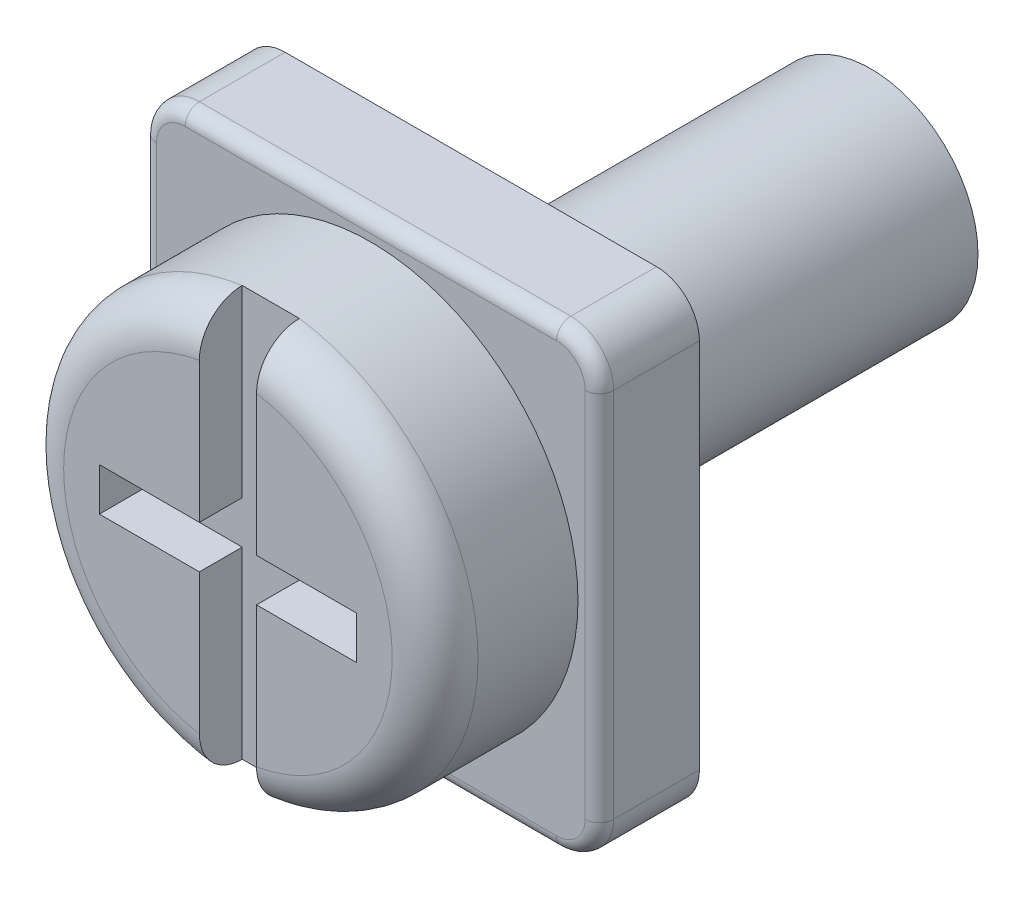
ISO-10303-21;
HEADER;
FILE_DESCRIPTION(('STEP AP214'),'2;1');
FILE_NAME('part.step','',(''),(''),'','','');
FILE_SCHEMA(('AUTOMOTIVE_DESIGN { 1 0 10303 214 1 1 1 1 }'));
ENDSEC;
DATA;
#1=APPLICATION_CONTEXT('core data for automotive mechanical design processes');
#2=APPLICATION_PROTOCOL_DEFINITION('international standard','automotive_design',2000,#1);
#3=PRODUCT_CONTEXT('',#1,'mechanical');
#4=PRODUCT('Part','Part','',(#3));
#5=PRODUCT_RELATED_PRODUCT_CATEGORY('part','',(#4));
#6=PRODUCT_DEFINITION_FORMATION('','',#4);
#7=PRODUCT_DEFINITION_CONTEXT('part definition',#1,'design');
#8=PRODUCT_DEFINITION('design','',#6,#7);
#9=PRODUCT_DEFINITION_SHAPE('','',#8);
#10=(LENGTH_UNIT() NAMED_UNIT(*) SI_UNIT(.MILLI.,.METRE.));
#11=(NAMED_UNIT(*) PLANE_ANGLE_UNIT() SI_UNIT($,.RADIAN.));
#12=(NAMED_UNIT(*) SI_UNIT($,.STERADIAN.) SOLID_ANGLE_UNIT());
#13=UNCERTAINTY_MEASURE_WITH_UNIT(LENGTH_MEASURE(1.E-05),#10,'distance_accuracy_value','');
#14=(GEOMETRIC_REPRESENTATION_CONTEXT(3) GLOBAL_UNCERTAINTY_ASSIGNED_CONTEXT((#13)) GLOBAL_UNIT_ASSIGNED_CONTEXT((#10,
#11,#12)) REPRESENTATION_CONTEXT('',''));
#15=CARTESIAN_POINT('',(0.,0.,0.));
#16=DIRECTION('',(0.,0.,1.));
#17=DIRECTION('',(1.,0.,0.));
#18=AXIS2_PLACEMENT_3D('',#15,#16,#17);
#19=CARTESIAN_POINT('',(0.,0.,2.));
#20=DIRECTION('',(0.,0.,1.));
#21=DIRECTION('',(1.,0.,0.));
#22=AXIS2_PLACEMENT_3D('',#19,#20,#21);
#23=PLANE('',#22);
#24=DIRECTION('',(0.,-1.,0.));
#25=VECTOR('',#24,1.);
#26=CARTESIAN_POINT('',(-0.4,2.87228132326901,2.));
#27=LINE('',#26,#25);
#28=CARTESIAN_POINT('',(-0.4,2.26495033058122,2.));
#29=VERTEX_POINT('',#28);
#30=CARTESIAN_POINT('',(-0.4,0.3,2.));
#31=VERTEX_POINT('',#30);
#32=EDGE_CURVE('E337',#29,#31,#27,.T.);
#33=ORIENTED_EDGE('',*,*,#32,.F.);
#34=CARTESIAN_POINT('',(0.,0.,2.));
#35=DIRECTION('',(0.,0.,1.));
#36=DIRECTION('',(1.,0.,0.));
#37=AXIS2_PLACEMENT_3D('',#34,#35,#36);
#38=CIRCLE('',#37,2.3);
#39=CARTESIAN_POINT('',(-0.4,-2.26495033058123,2.));
#40=VERTEX_POINT('',#39);
#41=EDGE_CURVE('E206',#29,#40,#38,.T.);
#42=ORIENTED_EDGE('',*,*,#41,.T.);
#43=DIRECTION('',(0.,-1.,0.));
#44=VECTOR('',#43,1.);
#45=CARTESIAN_POINT('',(-0.4,-0.299999999999999,2.));
#46=LINE('',#45,#44);
#47=CARTESIAN_POINT('',(-0.4,-0.299999999999999,2.));
#48=VERTEX_POINT('',#47);
#49=EDGE_CURVE('E200',#48,#40,#46,.T.);
#50=ORIENTED_EDGE('',*,*,#49,.F.);
#51=DIRECTION('',(1.,0.,0.));
#52=VECTOR('',#51,1.);
#53=CARTESIAN_POINT('',(-1.8,-0.3,2.));
#54=LINE('',#53,#52);
#55=CARTESIAN_POINT('',(-1.8,-0.3,2.));
#56=VERTEX_POINT('',#55);
#57=EDGE_CURVE('E368',#56,#48,#54,.T.);
#58=ORIENTED_EDGE('',*,*,#57,.F.);
#59=DIRECTION('',(0.,-1.,0.));
#60=VECTOR('',#59,1.);
#61=CARTESIAN_POINT('',(-1.8,0.3,2.));
#62=LINE('',#61,#60);
#63=CARTESIAN_POINT('',(-1.8,0.3,2.));
#64=VERTEX_POINT('',#63);
#65=EDGE_CURVE('E361',#64,#56,#62,.T.);
#66=ORIENTED_EDGE('',*,*,#65,.F.);
#67=DIRECTION('',(-1.,0.,0.));
#68=VECTOR('',#67,1.);
#69=CARTESIAN_POINT('',(-1.8,0.3,2.));
#70=LINE('',#69,#68);
#71=EDGE_CURVE('E351',#31,#64,#70,.T.);
#72=ORIENTED_EDGE('',*,*,#71,.F.);
#73=EDGE_LOOP('',(#33,#42,#50,#58,#66,#72));
#74=FACE_BOUND('',#73,.T.);
#75=ADVANCED_FACE('F32',(#74),#23,.T.);
#76=DIRECTION('',(0.,1.,0.));
#77=VECTOR('',#76,1.);
#78=CARTESIAN_POINT('',(0.4,-0.3,2.));
#79=LINE('',#78,#77);
#80=CARTESIAN_POINT('',(0.4,-2.26495033058122,2.));
#81=VERTEX_POINT('',#80);
#82=CARTESIAN_POINT('',(0.4,-0.3,2.));
#83=VERTEX_POINT('',#82);
#84=EDGE_CURVE('E373',#81,#83,#79,.T.);
#85=ORIENTED_EDGE('',*,*,#84,.F.);
#86=CARTESIAN_POINT('',(0.,0.,2.));
#87=DIRECTION('',(0.,0.,1.));
#88=DIRECTION('',(1.,0.,0.));
#89=AXIS2_PLACEMENT_3D('',#86,#87,#88);
#90=CIRCLE('',#89,2.3);
#91=CARTESIAN_POINT('',(0.4,2.26495033058123,2.));
#92=VERTEX_POINT('',#91);
#93=EDGE_CURVE('E240',#81,#92,#90,.T.);
#94=ORIENTED_EDGE('',*,*,#93,.T.);
#95=DIRECTION('',(0.,1.,0.));
#96=VECTOR('',#95,1.);
#97=CARTESIAN_POINT('',(0.4,2.87228132326901,2.));
#98=LINE('',#97,#96);
#99=CARTESIAN_POINT('',(0.4,0.3,2.));
#100=VERTEX_POINT('',#99);
#101=EDGE_CURVE('E348',#100,#92,#98,.T.);
#102=ORIENTED_EDGE('',*,*,#101,.F.);
#103=DIRECTION('',(-1.,0.,0.));
#104=VECTOR('',#103,1.);
#105=CARTESIAN_POINT('',(0.4,0.3,2.));
#106=LINE('',#105,#104);
#107=CARTESIAN_POINT('',(1.8,0.3,2.));
#108=VERTEX_POINT('',#107);
#109=EDGE_CURVE('E381',#108,#100,#106,.T.);
#110=ORIENTED_EDGE('',*,*,#109,.F.);
#111=DIRECTION('',(0.,1.,0.));
#112=VECTOR('',#111,1.);
#113=CARTESIAN_POINT('',(1.8,0.3,2.));
#114=LINE('',#113,#112);
#115=CARTESIAN_POINT('',(1.8,-0.3,2.));
#116=VERTEX_POINT('',#115);
#117=EDGE_CURVE('E377',#116,#108,#114,.T.);
#118=ORIENTED_EDGE('',*,*,#117,.F.);
#119=DIRECTION('',(1.,0.,0.));
#120=VECTOR('',#119,1.);
#121=CARTESIAN_POINT('',(0.4,-0.3,2.));
#122=LINE('',#121,#120);
#123=EDGE_CURVE('E378',#83,#116,#122,.T.);
#124=ORIENTED_EDGE('',*,*,#123,.F.);
#125=EDGE_LOOP('',(#85,#94,#102,#110,#118,#124));
#126=FACE_BOUND('',#125,.T.);
#127=ADVANCED_FACE('F294',(#126),#23,.T.);
#128=CARTESIAN_POINT('',(0.,0.,0.));
#129=DIRECTION('',(0.,0.,1.));
#130=DIRECTION('',(1.,0.,0.));
#131=AXIS2_PLACEMENT_3D('',#128,#129,#130);
#132=PLANE('',#131);
#133=CARTESIAN_POINT('',(-2.6,-2.6,0.));
#134=DIRECTION('',(0.,0.,1.));
#135=DIRECTION('',(1.,0.,0.));
#136=AXIS2_PLACEMENT_3D('',#133,#134,#135);
#137=CIRCLE('',#136,0.4);
#138=CARTESIAN_POINT('',(-3.,-2.6,0.));
#139=VERTEX_POINT('',#138);
#140=CARTESIAN_POINT('',(-2.6,-3.,0.));
#141=VERTEX_POINT('',#140);
#142=EDGE_CURVE('E473',#139,#141,#137,.T.);
#143=ORIENTED_EDGE('',*,*,#142,.T.);
#144=DIRECTION('',(1.,0.,0.));
#145=VECTOR('',#144,1.);
#146=CARTESIAN_POINT('',(0.,-3.,0.));
#147=LINE('',#146,#145);
#148=CARTESIAN_POINT('',(2.6,-3.,0.));
#149=VERTEX_POINT('',#148);
#150=EDGE_CURVE('E477',#141,#149,#147,.T.);
#151=ORIENTED_EDGE('',*,*,#150,.T.);
#152=CARTESIAN_POINT('',(2.6,-2.6,0.));
#153=DIRECTION('',(0.,0.,1.));
#154=DIRECTION('',(1.,0.,0.));
#155=AXIS2_PLACEMENT_3D('',#152,#153,#154);
#156=CIRCLE('',#155,0.4);
#157=CARTESIAN_POINT('',(3.,-2.6,0.));
#158=VERTEX_POINT('',#157);
#159=EDGE_CURVE('E475',#149,#158,#156,.T.);
#160=ORIENTED_EDGE('',*,*,#159,.T.);
#161=DIRECTION('',(0.,1.,0.));
#162=VECTOR('',#161,1.);
#163=CARTESIAN_POINT('',(3.,0.,0.));
#164=LINE('',#163,#162);
#165=CARTESIAN_POINT('',(3.,2.6,0.));
#166=VERTEX_POINT('',#165);
#167=EDGE_CURVE('E471',#158,#166,#164,.T.);
#168=ORIENTED_EDGE('',*,*,#167,.T.);
#169=CARTESIAN_POINT('',(2.6,2.6,0.));
#170=DIRECTION('',(0.,0.,1.));
#171=DIRECTION('',(1.,0.,0.));
#172=AXIS2_PLACEMENT_3D('',#169,#170,#171);
#173=CIRCLE('',#172,0.4);
#174=CARTESIAN_POINT('',(2.6,3.,0.));
#175=VERTEX_POINT('',#174);
#176=EDGE_CURVE('E467',#166,#175,#173,.T.);
#177=ORIENTED_EDGE('',*,*,#176,.T.);
#178=DIRECTION('',(-1.,0.,0.));
#179=VECTOR('',#178,1.);
#180=CARTESIAN_POINT('',(0.,3.,0.));
#181=LINE('',#180,#179);
#182=CARTESIAN_POINT('',(-2.6,3.,0.));
#183=VERTEX_POINT('',#182);
#184=EDGE_CURVE('E463',#175,#183,#181,.T.);
#185=ORIENTED_EDGE('',*,*,#184,.T.);
#186=CARTESIAN_POINT('',(-2.6,2.6,0.));
#187=DIRECTION('',(0.,0.,1.));
#188=DIRECTION('',(1.,0.,0.));
#189=AXIS2_PLACEMENT_3D('',#186,#187,#188);
#190=CIRCLE('',#189,0.4);
#191=CARTESIAN_POINT('',(-3.,2.6,0.));
#192=VERTEX_POINT('',#191);
#193=EDGE_CURVE('E465',#183,#192,#190,.T.);
#194=ORIENTED_EDGE('',*,*,#193,.T.);
#195=DIRECTION('',(0.,-1.,0.));
#196=VECTOR('',#195,1.);
#197=CARTESIAN_POINT('',(-3.,0.,0.));
#198=LINE('',#197,#196);
#199=EDGE_CURVE('E469',#192,#139,#198,.T.);
#200=ORIENTED_EDGE('',*,*,#199,.T.);
#201=EDGE_LOOP('',(#143,#151,#160,#168,#177,#185,#194,#200));
#202=FACE_BOUND('',#201,.T.);
#203=CARTESIAN_POINT('',(0.,0.,0.));
#204=DIRECTION('',(0.,0.,1.));
#205=DIRECTION('',(1.,0.,0.));
#206=AXIS2_PLACEMENT_3D('',#203,#204,#205);
#207=CIRCLE('',#206,2.9);
#208=CARTESIAN_POINT('',(2.9,0.,0.));
#209=VERTEX_POINT('',#208);
#210=EDGE_CURVE('E401',#209,#209,#207,.T.);
#211=ORIENTED_EDGE('',*,*,#210,.F.);
#212=EDGE_LOOP('',(#211));
#213=FACE_BOUND('',#212,.T.);
#214=ADVANCED_FACE('F578',(#202,#213),#132,.T.);
#215=CARTESIAN_POINT('',(0.,0.,-7.));
#216=DIRECTION('',(0.,0.,1.));
#217=DIRECTION('',(1.,0.,0.));
#218=AXIS2_PLACEMENT_3D('',#215,#216,#217);
#219=CYLINDRICAL_SURFACE('',#218,1.5);
#220=CARTESIAN_POINT('',(0.,0.,-7.));
#221=DIRECTION('',(0.,0.,1.));
#222=DIRECTION('',(1.,0.,0.));
#223=AXIS2_PLACEMENT_3D('',#220,#221,#222);
#224=CIRCLE('',#223,1.5);
#225=CARTESIAN_POINT('',(1.5,0.,-7.));
#226=VERTEX_POINT('',#225);
#227=EDGE_CURVE('E422',#226,#226,#224,.T.);
#228=ORIENTED_EDGE('',*,*,#227,.T.);
#229=EDGE_LOOP('',(#228));
#230=FACE_BOUND('',#229,.T.);
#231=CARTESIAN_POINT('',(0.,0.,-1.4));
#232=DIRECTION('',(0.,0.,1.));
#233=DIRECTION('',(1.,0.,0.));
#234=AXIS2_PLACEMENT_3D('',#231,#232,#233);
#235=CIRCLE('',#234,1.5);
#236=CARTESIAN_POINT('',(1.5,0.,-1.4));
#237=VERTEX_POINT('',#236);
#238=EDGE_CURVE('E414',#237,#237,#235,.F.);
#239=ORIENTED_EDGE('',*,*,#238,.T.);
#240=EDGE_LOOP('',(#239));
#241=FACE_BOUND('',#240,.T.);
#242=ADVANCED_FACE('F427',(#230,#241),#219,.T.);
#243=CARTESIAN_POINT('',(0.,0.,-7.));
#244=DIRECTION('',(0.,0.,1.));
#245=DIRECTION('',(1.,0.,0.));
#246=AXIS2_PLACEMENT_3D('',#243,#244,#245);
#247=PLANE('',#246);
#248=ORIENTED_EDGE('',*,*,#227,.F.);
#249=EDGE_LOOP('',(#248));
#250=FACE_BOUND('',#249,.T.);
#251=ADVANCED_FACE('F572',(#250),#247,.F.);
#252=CARTESIAN_POINT('',(-3.2,3.2,-1.4));
#253=DIRECTION('',(-1.,0.,0.));
#254=DIRECTION('',(0.,-1.,0.));
#255=AXIS2_PLACEMENT_3D('',#252,#253,#254);
#256=PLANE('',#255);
#257=DIRECTION('',(0.,0.,1.));
#258=VECTOR('',#257,1.);
#259=CARTESIAN_POINT('',(-3.2,-2.6,-1.4));
#260=LINE('',#259,#258);
#261=CARTESIAN_POINT('',(-3.2,-2.6,-1.4));
#262=VERTEX_POINT('',#261);
#263=CARTESIAN_POINT('',(-3.2,-2.6,-0.2));
#264=VERTEX_POINT('',#263);
#265=EDGE_CURVE('E451',#262,#264,#260,.T.);
#266=ORIENTED_EDGE('',*,*,#265,.T.);
#267=DIRECTION('',(0.,-1.,0.));
#268=VECTOR('',#267,1.);
#269=CARTESIAN_POINT('',(-3.2,3.2,-0.2));
#270=LINE('',#269,#268);
#271=CARTESIAN_POINT('',(-3.2,2.6,-0.2));
#272=VERTEX_POINT('',#271);
#273=EDGE_CURVE('E489',#264,#272,#270,.F.);
#274=ORIENTED_EDGE('',*,*,#273,.T.);
#275=DIRECTION('',(0.,0.,1.));
#276=VECTOR('',#275,1.);
#277=CARTESIAN_POINT('',(-3.2,2.6,-1.4));
#278=LINE('',#277,#276);
#279=CARTESIAN_POINT('',(-3.2,2.6,-1.4));
#280=VERTEX_POINT('',#279);
#281=EDGE_CURVE('E448',#272,#280,#278,.F.);
#282=ORIENTED_EDGE('',*,*,#281,.T.);
#283=DIRECTION('',(0.,-1.,0.));
#284=VECTOR('',#283,1.);
#285=CARTESIAN_POINT('',(-3.2,3.2,-1.4));
#286=LINE('',#285,#284);
#287=EDGE_CURVE('E410',#280,#262,#286,.T.);
#288=ORIENTED_EDGE('',*,*,#287,.T.);
#289=EDGE_LOOP('',(#266,#274,#282,#288));
#290=FACE_BOUND('',#289,.T.);
#291=ADVANCED_FACE('F561',(#290),#256,.T.);
#292=CARTESIAN_POINT('',(-3.2,3.2,-1.4));
#293=DIRECTION('',(0.,1.,0.));
#294=DIRECTION('',(0.,0.,1.));
#295=AXIS2_PLACEMENT_3D('',#292,#293,#294);
#296=PLANE('',#295);
#297=DIRECTION('',(0.,0.,1.));
#298=VECTOR('',#297,1.);
#299=CARTESIAN_POINT('',(-2.6,3.2,-1.4));
#300=LINE('',#299,#298);
#301=CARTESIAN_POINT('',(-2.6,3.2,-1.4));
#302=VERTEX_POINT('',#301);
#303=CARTESIAN_POINT('',(-2.6,3.2,-0.2));
#304=VERTEX_POINT('',#303);
#305=EDGE_CURVE('E528',#302,#304,#300,.T.);
#306=ORIENTED_EDGE('',*,*,#305,.T.);
#307=DIRECTION('',(-1.,0.,0.));
#308=VECTOR('',#307,1.);
#309=CARTESIAN_POINT('',(-3.2,3.2,-0.2));
#310=LINE('',#309,#308);
#311=CARTESIAN_POINT('',(2.6,3.2,-0.2));
#312=VERTEX_POINT('',#311);
#313=EDGE_CURVE('E11',#304,#312,#310,.F.);
#314=ORIENTED_EDGE('',*,*,#313,.T.);
#315=DIRECTION('',(0.,0.,1.));
#316=VECTOR('',#315,1.);
#317=CARTESIAN_POINT('',(2.6,3.2,-1.4));
#318=LINE('',#317,#316);
#319=CARTESIAN_POINT('',(2.6,3.2,-1.4));
#320=VERTEX_POINT('',#319);
#321=EDGE_CURVE('E444',#312,#320,#318,.F.);
#322=ORIENTED_EDGE('',*,*,#321,.T.);
#323=DIRECTION('',(-1.,0.,0.));
#324=VECTOR('',#323,1.);
#325=CARTESIAN_POINT('',(-3.2,3.2,-1.4));
#326=LINE('',#325,#324);
#327=EDGE_CURVE('E413',#320,#302,#326,.T.);
#328=ORIENTED_EDGE('',*,*,#327,.T.);
#329=EDGE_LOOP('',(#306,#314,#322,#328));
#330=FACE_BOUND('',#329,.T.);
#331=ADVANCED_FACE('F564',(#330),#296,.T.);
#332=CARTESIAN_POINT('',(3.2,3.2,-1.4));
#333=DIRECTION('',(1.,0.,0.));
#334=DIRECTION('',(0.,1.,0.));
#335=AXIS2_PLACEMENT_3D('',#332,#333,#334);
#336=PLANE('',#335);
#337=DIRECTION('',(0.,0.,1.));
#338=VECTOR('',#337,1.);
#339=CARTESIAN_POINT('',(3.2,2.6,-1.4));
#340=LINE('',#339,#338);
#341=CARTESIAN_POINT('',(3.2,2.6,-1.4));
#342=VERTEX_POINT('',#341);
#343=CARTESIAN_POINT('',(3.2,2.6,-0.2));
#344=VERTEX_POINT('',#343);
#345=EDGE_CURVE('E447',#342,#344,#340,.T.);
#346=ORIENTED_EDGE('',*,*,#345,.T.);
#347=DIRECTION('',(0.,1.,0.));
#348=VECTOR('',#347,1.);
#349=CARTESIAN_POINT('',(3.2,3.2,-0.2));
#350=LINE('',#349,#348);
#351=CARTESIAN_POINT('',(3.2,-2.6,-0.2));
#352=VERTEX_POINT('',#351);
#353=EDGE_CURVE('E487',#344,#352,#350,.F.);
#354=ORIENTED_EDGE('',*,*,#353,.T.);
#355=DIRECTION('',(0.,0.,1.));
#356=VECTOR('',#355,1.);
#357=CARTESIAN_POINT('',(3.2,-2.6,-1.4));
#358=LINE('',#357,#356);
#359=CARTESIAN_POINT('',(3.2,-2.6,-1.4));
#360=VERTEX_POINT('',#359);
#361=EDGE_CURVE('E529',#352,#360,#358,.F.);
#362=ORIENTED_EDGE('',*,*,#361,.T.);
#363=DIRECTION('',(0.,1.,0.));
#364=VECTOR('',#363,1.);
#365=CARTESIAN_POINT('',(3.2,3.2,-1.4));
#366=LINE('',#365,#364);
#367=EDGE_CURVE('E417',#360,#342,#366,.T.);
#368=ORIENTED_EDGE('',*,*,#367,.T.);
#369=EDGE_LOOP('',(#346,#354,#362,#368));
#370=FACE_BOUND('',#369,.T.);
#371=ADVANCED_FACE('F526',(#370),#336,.T.);
#372=CARTESIAN_POINT('',(-3.2,-3.2,-1.4));
#373=DIRECTION('',(0.,-1.,0.));
#374=DIRECTION('',(0.,0.,-1.));
#375=AXIS2_PLACEMENT_3D('',#372,#373,#374);
#376=PLANE('',#375);
#377=DIRECTION('',(0.,0.,1.));
#378=VECTOR('',#377,1.);
#379=CARTESIAN_POINT('',(2.6,-3.2,-1.4));
#380=LINE('',#379,#378);
#381=CARTESIAN_POINT('',(2.6,-3.2,-1.4));
#382=VERTEX_POINT('',#381);
#383=CARTESIAN_POINT('',(2.6,-3.2,-0.2));
#384=VERTEX_POINT('',#383);
#385=EDGE_CURVE('E458',#382,#384,#380,.T.);
#386=ORIENTED_EDGE('',*,*,#385,.T.);
#387=DIRECTION('',(1.,0.,0.));
#388=VECTOR('',#387,1.);
#389=CARTESIAN_POINT('',(-3.2,-3.2,-0.2));
#390=LINE('',#389,#388);
#391=CARTESIAN_POINT('',(-2.6,-3.2,-0.2));
#392=VERTEX_POINT('',#391);
#393=EDGE_CURVE('E480',#384,#392,#390,.F.);
#394=ORIENTED_EDGE('',*,*,#393,.T.);
#395=DIRECTION('',(0.,0.,1.));
#396=VECTOR('',#395,1.);
#397=CARTESIAN_POINT('',(-2.6,-3.2,-1.4));
#398=LINE('',#397,#396);
#399=CARTESIAN_POINT('',(-2.6,-3.2,-1.4));
#400=VERTEX_POINT('',#399);
#401=EDGE_CURVE('E461',#392,#400,#398,.F.);
#402=ORIENTED_EDGE('',*,*,#401,.T.);
#403=DIRECTION('',(1.,0.,0.));
#404=VECTOR('',#403,1.);
#405=CARTESIAN_POINT('',(-3.2,-3.2,-1.4));
#406=LINE('',#405,#404);
#407=EDGE_CURVE('E404',#400,#382,#406,.T.);
#408=ORIENTED_EDGE('',*,*,#407,.T.);
#409=EDGE_LOOP('',(#386,#394,#402,#408));
#410=FACE_BOUND('',#409,.T.);
#411=ADVANCED_FACE('F432',(#410),#376,.T.);
#412=CARTESIAN_POINT('',(-3.2,3.2,-1.4));
#413=DIRECTION('',(0.,0.,1.));
#414=DIRECTION('',(1.,0.,0.));
#415=AXIS2_PLACEMENT_3D('',#412,#413,#414);
#416=PLANE('',#415);
#417=ORIENTED_EDGE('',*,*,#238,.F.);
#418=EDGE_LOOP('',(#417));
#419=FACE_BOUND('',#418,.T.);
#420=ORIENTED_EDGE('',*,*,#327,.F.);
#421=CARTESIAN_POINT('',(2.6,2.6,-1.4));
#422=DIRECTION('',(0.,0.,1.));
#423=DIRECTION('',(1.,0.,0.));
#424=AXIS2_PLACEMENT_3D('',#421,#422,#423);
#425=CIRCLE('',#424,0.6);
#426=EDGE_CURVE('E437',#320,#342,#425,.F.);
#427=ORIENTED_EDGE('',*,*,#426,.T.);
#428=ORIENTED_EDGE('',*,*,#367,.F.);
#429=CARTESIAN_POINT('',(2.6,-2.6,-1.4));
#430=DIRECTION('',(0.,0.,1.));
#431=DIRECTION('',(1.,0.,0.));
#432=AXIS2_PLACEMENT_3D('',#429,#430,#431);
#433=CIRCLE('',#432,0.6);
#434=EDGE_CURVE('E536',#360,#382,#433,.F.);
#435=ORIENTED_EDGE('',*,*,#434,.T.);
#436=ORIENTED_EDGE('',*,*,#407,.F.);
#437=CARTESIAN_POINT('',(-2.6,-2.6,-1.4));
#438=DIRECTION('',(0.,0.,1.));
#439=DIRECTION('',(1.,0.,0.));
#440=AXIS2_PLACEMENT_3D('',#437,#438,#439);
#441=CIRCLE('',#440,0.6);
#442=EDGE_CURVE('E449',#400,#262,#441,.F.);
#443=ORIENTED_EDGE('',*,*,#442,.T.);
#444=ORIENTED_EDGE('',*,*,#287,.F.);
#445=CARTESIAN_POINT('',(-2.6,2.6,-1.4));
#446=DIRECTION('',(0.,0.,1.));
#447=DIRECTION('',(1.,0.,0.));
#448=AXIS2_PLACEMENT_3D('',#445,#446,#447);
#449=CIRCLE('',#448,0.6);
#450=EDGE_CURVE('E440',#280,#302,#449,.F.);
#451=ORIENTED_EDGE('',*,*,#450,.T.);
#452=EDGE_LOOP('',(#420,#427,#428,#435,#436,#443,#444,#451));
#453=FACE_BOUND('',#452,.T.);
#454=ADVANCED_FACE('F429',(#419,#453),#416,.F.);
#455=CARTESIAN_POINT('',(0.,0.,2.));
#456=DIRECTION('',(0.,0.,-1.));
#457=DIRECTION('',(-1.,0.,0.));
#458=AXIS2_PLACEMENT_3D('',#455,#456,#457);
#459=CYLINDRICAL_SURFACE('',#458,2.9);
#460=CARTESIAN_POINT('',(0.4,2.87228132326901,1.4));
#461=DIRECTION('',(-1.,0.,0.));
#462=VECTOR('',#461,1.);
#463=LINE('',#460,#462);
#464=CARTESIAN_POINT('',(0.4,2.87228132326901,1.4));
#465=VERTEX_POINT('',#464);
#466=CARTESIAN_POINT('',(-0.4,2.87228132326901,1.4));
#467=VERTEX_POINT('',#466);
#468=EDGE_CURVE('E314',#465,#467,#463,.T.);
#469=ORIENTED_EDGE('',*,*,#468,.F.);
#470=CARTESIAN_POINT('',(0.,0.,1.4));
#471=DIRECTION('',(0.,0.,1.));
#472=DIRECTION('',(1.,0.,0.));
#473=AXIS2_PLACEMENT_3D('',#470,#471,#472);
#474=CIRCLE('',#473,2.9);
#475=CARTESIAN_POINT('',(0.4,-2.87228132326901,1.4));
#476=VERTEX_POINT('',#475);
#477=EDGE_CURVE('E229',#465,#476,#474,.F.);
#478=ORIENTED_EDGE('',*,*,#477,.T.);
#479=CARTESIAN_POINT('',(-0.4,-2.87228132326901,1.4));
#480=DIRECTION('',(1.,0.,0.));
#481=VECTOR('',#480,1.);
#482=LINE('',#479,#481);
#483=CARTESIAN_POINT('',(-0.4,-2.87228132326901,1.4));
#484=VERTEX_POINT('',#483);
#485=EDGE_CURVE('E214',#484,#476,#482,.T.);
#486=ORIENTED_EDGE('',*,*,#485,.F.);
#487=CARTESIAN_POINT('',(0.,0.,1.4));
#488=DIRECTION('',(0.,0.,1.));
#489=DIRECTION('',(1.,0.,0.));
#490=AXIS2_PLACEMENT_3D('',#487,#488,#489);
#491=CIRCLE('',#490,2.9);
#492=EDGE_CURVE('E226',#484,#467,#491,.F.);
#493=ORIENTED_EDGE('',*,*,#492,.T.);
#494=EDGE_LOOP('',(#469,#478,#486,#493));
#495=FACE_BOUND('',#494,.T.);
#496=ORIENTED_EDGE('',*,*,#210,.T.);
#497=EDGE_LOOP('',(#496));
#498=FACE_BOUND('',#497,.T.);
#499=ADVANCED_FACE('F224',(#495,#498),#459,.T.);
#500=CARTESIAN_POINT('',(-0.4,0.3,1.4));
#501=DIRECTION('',(0.,0.,1.));
#502=DIRECTION('',(1.,0.,0.));
#503=AXIS2_PLACEMENT_3D('',#500,#501,#502);
#504=PLANE('',#503);
#505=DIRECTION('',(0.,-1.,0.));
#506=VECTOR('',#505,1.);
#507=CARTESIAN_POINT('',(-0.4,2.87228132326901,1.4));
#508=LINE('',#507,#506);
#509=CARTESIAN_POINT('',(-0.4,0.3,1.4));
#510=VERTEX_POINT('',#509);
#511=EDGE_CURVE('E335',#467,#510,#508,.T.);
#512=ORIENTED_EDGE('',*,*,#511,.T.);
#513=DIRECTION('',(-1.,0.,0.));
#514=VECTOR('',#513,1.);
#515=CARTESIAN_POINT('',(-1.8,0.3,1.4));
#516=LINE('',#515,#514);
#517=CARTESIAN_POINT('',(-1.8,0.3,1.4));
#518=VERTEX_POINT('',#517);
#519=EDGE_CURVE('E332',#510,#518,#516,.T.);
#520=ORIENTED_EDGE('',*,*,#519,.T.);
#521=DIRECTION('',(0.,-1.,0.));
#522=VECTOR('',#521,1.);
#523=CARTESIAN_POINT('',(-1.8,0.3,1.4));
#524=LINE('',#523,#522);
#525=CARTESIAN_POINT('',(-1.8,-0.3,1.4));
#526=VERTEX_POINT('',#525);
#527=EDGE_CURVE('E330',#518,#526,#524,.T.);
#528=ORIENTED_EDGE('',*,*,#527,.T.);
#529=DIRECTION('',(1.,0.,0.));
#530=VECTOR('',#529,1.);
#531=CARTESIAN_POINT('',(-1.8,-0.3,1.4));
#532=LINE('',#531,#530);
#533=CARTESIAN_POINT('',(-0.4,-0.299999999999999,1.4));
#534=VERTEX_POINT('',#533);
#535=EDGE_CURVE('E219',#526,#534,#532,.T.);
#536=ORIENTED_EDGE('',*,*,#535,.T.);
#537=DIRECTION('',(0.,-1.,0.));
#538=VECTOR('',#537,1.);
#539=CARTESIAN_POINT('',(-0.4,-0.299999999999999,1.4));
#540=LINE('',#539,#538);
#541=EDGE_CURVE('E197',#534,#484,#540,.T.);
#542=ORIENTED_EDGE('',*,*,#541,.T.);
#543=ORIENTED_EDGE('',*,*,#485,.T.);
#544=DIRECTION('',(0.,1.,0.));
#545=VECTOR('',#544,1.);
#546=CARTESIAN_POINT('',(0.4,-0.3,1.4));
#547=LINE('',#546,#545);
#548=CARTESIAN_POINT('',(0.4,-0.3,1.4));
#549=VERTEX_POINT('',#548);
#550=EDGE_CURVE('E231',#476,#549,#547,.T.);
#551=ORIENTED_EDGE('',*,*,#550,.T.);
#552=DIRECTION('',(1.,0.,0.));
#553=VECTOR('',#552,1.);
#554=CARTESIAN_POINT('',(0.4,-0.3,1.4));
#555=LINE('',#554,#553);
#556=CARTESIAN_POINT('',(1.8,-0.3,1.4));
#557=VERTEX_POINT('',#556);
#558=EDGE_CURVE('E318',#549,#557,#555,.T.);
#559=ORIENTED_EDGE('',*,*,#558,.T.);
#560=DIRECTION('',(0.,1.,0.));
#561=VECTOR('',#560,1.);
#562=CARTESIAN_POINT('',(1.8,0.3,1.4));
#563=LINE('',#562,#561);
#564=CARTESIAN_POINT('',(1.8,0.3,1.4));
#565=VERTEX_POINT('',#564);
#566=EDGE_CURVE('E321',#557,#565,#563,.T.);
#567=ORIENTED_EDGE('',*,*,#566,.T.);
#568=DIRECTION('',(-1.,0.,0.));
#569=VECTOR('',#568,1.);
#570=CARTESIAN_POINT('',(0.4,0.3,1.4));
#571=LINE('',#570,#569);
#572=CARTESIAN_POINT('',(0.4,0.3,1.4));
#573=VERTEX_POINT('',#572);
#574=EDGE_CURVE('E325',#565,#573,#571,.T.);
#575=ORIENTED_EDGE('',*,*,#574,.T.);
#576=DIRECTION('',(0.,1.,0.));
#577=VECTOR('',#576,1.);
#578=CARTESIAN_POINT('',(0.4,2.87228132326901,1.4));
#579=LINE('',#578,#577);
#580=EDGE_CURVE('E304',#573,#465,#579,.T.);
#581=ORIENTED_EDGE('',*,*,#580,.T.);
#582=ORIENTED_EDGE('',*,*,#468,.T.);
#583=EDGE_LOOP('',(#512,#520,#528,#536,#542,#543,#551,#559,#567,#575,#581,#582));
#584=FACE_BOUND('',#583,.T.);
#585=ADVANCED_FACE('F212',(#584),#504,.T.);
#586=CARTESIAN_POINT('',(-1.8,0.3,1.4));
#587=DIRECTION('',(0.,1.,0.));
#588=DIRECTION('',(-1.,0.,0.));
#589=AXIS2_PLACEMENT_3D('',#586,#587,#588);
#590=PLANE('',#589);
#591=ORIENTED_EDGE('',*,*,#71,.T.);
#592=DIRECTION('',(0.,0.,1.));
#593=VECTOR('',#592,1.);
#594=CARTESIAN_POINT('',(-1.8,0.3,1.4));
#595=LINE('',#594,#593);
#596=EDGE_CURVE('E365',#518,#64,#595,.T.);
#597=ORIENTED_EDGE('',*,*,#596,.F.);
#598=ORIENTED_EDGE('',*,*,#519,.F.);
#599=DIRECTION('',(0.,0.,1.));
#600=VECTOR('',#599,1.);
#601=CARTESIAN_POINT('',(-0.4,0.3,1.4));
#602=LINE('',#601,#600);
#603=EDGE_CURVE('E357',#510,#31,#602,.T.);
#604=ORIENTED_EDGE('',*,*,#603,.T.);
#605=EDGE_LOOP('',(#591,#597,#598,#604));
#606=FACE_BOUND('',#605,.T.);
#607=ADVANCED_FACE('F293',(#606),#590,.F.);
#608=CARTESIAN_POINT('',(-1.8,0.3,1.4));
#609=DIRECTION('',(-1.,0.,0.));
#610=DIRECTION('',(0.,0.,1.));
#611=AXIS2_PLACEMENT_3D('',#608,#609,#610);
#612=PLANE('',#611);
#613=ORIENTED_EDGE('',*,*,#65,.T.);
#614=DIRECTION('',(0.,0.,1.));
#615=VECTOR('',#614,1.);
#616=CARTESIAN_POINT('',(-1.8,-0.3,1.4));
#617=LINE('',#616,#615);
#618=EDGE_CURVE('E369',#526,#56,#617,.T.);
#619=ORIENTED_EDGE('',*,*,#618,.F.);
#620=ORIENTED_EDGE('',*,*,#527,.F.);
#621=ORIENTED_EDGE('',*,*,#596,.T.);
#622=EDGE_LOOP('',(#613,#619,#620,#621));
#623=FACE_BOUND('',#622,.T.);
#624=ADVANCED_FACE('F399',(#623),#612,.F.);
#625=CARTESIAN_POINT('',(-1.8,-0.3,1.4));
#626=DIRECTION('',(0.,-1.,0.));
#627=DIRECTION('',(1.,0.,0.));
#628=AXIS2_PLACEMENT_3D('',#625,#626,#627);
#629=PLANE('',#628);
#630=ORIENTED_EDGE('',*,*,#57,.T.);
#631=DIRECTION('',(0.,0.,1.));
#632=VECTOR('',#631,1.);
#633=CARTESIAN_POINT('',(-0.4,-0.299999999999999,1.4));
#634=LINE('',#633,#632);
#635=EDGE_CURVE('E371',#534,#48,#634,.T.);
#636=ORIENTED_EDGE('',*,*,#635,.F.);
#637=ORIENTED_EDGE('',*,*,#535,.F.);
#638=ORIENTED_EDGE('',*,*,#618,.T.);
#639=EDGE_LOOP('',(#630,#636,#637,#638));
#640=FACE_BOUND('',#639,.T.);
#641=ADVANCED_FACE('F396',(#640),#629,.F.);
#642=CARTESIAN_POINT('',(-0.4,-0.299999999999999,1.4));
#643=DIRECTION('',(-1.,0.,0.));
#644=DIRECTION('',(0.,-1.,0.));
#645=AXIS2_PLACEMENT_3D('',#642,#643,#644);
#646=PLANE('',#645);
#647=ORIENTED_EDGE('',*,*,#49,.T.);
#648=CARTESIAN_POINT('',(-0.4,-2.26495033058123,2.));
#649=CARTESIAN_POINT('',(-0.4,-2.29946203360817,2.00002837952601));
#650=CARTESIAN_POINT('',(-0.4,-2.33397125031081,1.99711393829644));
#651=CARTESIAN_POINT('',(-0.4,-2.4020128285181,1.98557785758192));
#652=CARTESIAN_POINT('',(-0.4,-2.43554545510986,1.97695778220486));
#653=CARTESIAN_POINT('',(-0.4,-2.50070667665538,1.95418005051806));
#654=CARTESIAN_POINT('',(-0.4,-2.53233380603706,1.94001819305714));
#655=CARTESIAN_POINT('',(-0.4,-2.59272136701101,1.90654415635144));
#656=CARTESIAN_POINT('',(-0.4,-2.62148279558498,1.88723377694043));
#657=CARTESIAN_POINT('',(-0.4,-2.67505091167553,1.84418535157909));
#658=CARTESIAN_POINT('',(-0.4,-2.69989077812776,1.82048860201742));
#659=CARTESIAN_POINT('',(-0.4,-2.74518857586647,1.76921125894836));
#660=CARTESIAN_POINT('',(-0.4,-2.7656456839069,1.74162993738275));
#661=CARTESIAN_POINT('',(-0.4,-2.80134678063392,1.68371369327754));
#662=CARTESIAN_POINT('',(-0.4,-2.81664722543077,1.65341352208743));
#663=CARTESIAN_POINT('',(-0.4,-2.84188658379718,1.59066768779147));
#664=CARTESIAN_POINT('',(-0.4,-2.85182944252367,1.55822362319955));
#665=CARTESIAN_POINT('',(-0.4,-2.86337922791041,1.50462327835179));
#666=CARTESIAN_POINT('',(-0.4,-2.86671570768774,1.48382392975002));
#667=CARTESIAN_POINT('',(-0.4,-2.87116619759409,1.44201949436544));
#668=CARTESIAN_POINT('',(-0.4,-2.87228343570523,1.42101475112716));
#669=CARTESIAN_POINT('',(-0.4,-2.87228132326901,1.4));
#670=B_SPLINE_CURVE_WITH_KNOTS('',3,(#648,#649,#650,#651,#652,#653,#654,#655,#656,#657,#658,
#659,#660,#661,#662,#663,#664,#665,#666,#667,#668,#669),.UNSPECIFIED.,.F.,.F.,(4,2,2,2,2,2,2,2,
2,2,4),(0.,0.103409195293093,0.206790054351352,0.310249437363545,0.413672700088385,
0.516167682310481,0.618681900078642,0.720034253507311,0.821311871921369,0.884398729528184,
0.947393757205542),.UNSPECIFIED.);
#671=EDGE_CURVE('E194',#40,#484,#670,.T.);
#672=ORIENTED_EDGE('',*,*,#671,.T.);
#673=ORIENTED_EDGE('',*,*,#541,.F.);
#674=ORIENTED_EDGE('',*,*,#635,.T.);
#675=EDGE_LOOP('',(#647,#672,#673,#674));
#676=FACE_BOUND('',#675,.T.);
#677=ADVANCED_FACE('F196',(#676),#646,.F.);
#678=CARTESIAN_POINT('',(0.4,-0.3,1.4));
#679=DIRECTION('',(1.,0.,0.));
#680=DIRECTION('',(0.,1.,0.));
#681=AXIS2_PLACEMENT_3D('',#678,#679,#680);
#682=PLANE('',#681);
#683=ORIENTED_EDGE('',*,*,#550,.F.);
#684=CARTESIAN_POINT('',(0.400000000000002,-2.87228132326901,1.4));
#685=CARTESIAN_POINT('',(0.400000000000001,-2.87231106569209,1.43350619613121));
#686=CARTESIAN_POINT('',(0.400000000000001,-2.86944941325686,1.46700228988477));
#687=CARTESIAN_POINT('',(0.4,-2.85816457099673,1.53301047296087));
#688=CARTESIAN_POINT('',(0.4,-2.84974706392259,1.56552353227073));
#689=CARTESIAN_POINT('',(0.4,-2.82756645961809,1.62868683810332));
#690=CARTESIAN_POINT('',(0.4,-2.81380120372825,1.65933632659622));
#691=CARTESIAN_POINT('',(0.4,-2.78134207706438,1.71789707947902));
#692=CARTESIAN_POINT('',(0.4,-2.76264875567309,1.74580864861769));
#693=CARTESIAN_POINT('',(0.4,-2.72079907898196,1.7982219420439));
#694=CARTESIAN_POINT('',(0.4,-2.69762684235186,1.82271098187117));
#695=CARTESIAN_POINT('',(0.4,-2.6475290203105,1.86749766953574));
#696=CARTESIAN_POINT('',(0.4,-2.62060272654242,1.8877945245477));
#697=CARTESIAN_POINT('',(0.4,-2.56350227100066,1.92382295424207));
#698=CARTESIAN_POINT('',(0.4,-2.53330012607092,1.93951012400127));
#699=CARTESIAN_POINT('',(0.4,-2.47071570857722,1.96565353510265));
#700=CARTESIAN_POINT('',(0.4,-2.43833422954252,1.976111668851));
#701=CARTESIAN_POINT('',(0.4,-2.38232527954717,1.9892073991002));
#702=CARTESIAN_POINT('',(0.4,-2.35901674555118,1.99325426131296));
#703=CARTESIAN_POINT('',(0.4,-2.3121248280391,1.99865037538784));
#704=CARTESIAN_POINT('',(0.4,-2.28854190905328,2.0000036630941));
#705=CARTESIAN_POINT('',(0.4,-2.26495033058123,2.));
#706=B_SPLINE_CURVE_WITH_KNOTS('',3,(#684,#685,#686,#687,#688,#689,#690,#691,#692,#693,#694,
#695,#696,#697,#698,#699,#700,#701,#702,#703,#704,#705),.UNSPECIFIED.,.F.,.F.,(4,2,2,2,2,2,2,2,
2,2,4),(0.,0.100381832374089,0.200661148969911,0.3009809862032,0.40128964446598,
0.501960727344854,0.602650831725468,0.704281271643752,0.805874904484709,0.876699784430734,
0.947418465718848),.UNSPECIFIED.);
#707=EDGE_CURVE('E238',#476,#81,#706,.T.);
#708=ORIENTED_EDGE('',*,*,#707,.T.);
#709=ORIENTED_EDGE('',*,*,#84,.T.);
#710=DIRECTION('',(0.,0.,1.));
#711=VECTOR('',#710,1.);
#712=CARTESIAN_POINT('',(0.4,-0.3,1.4));
#713=LINE('',#712,#711);
#714=EDGE_CURVE('E374',#549,#83,#713,.T.);
#715=ORIENTED_EDGE('',*,*,#714,.F.);
#716=EDGE_LOOP('',(#683,#708,#709,#715));
#717=FACE_BOUND('',#716,.T.);
#718=ADVANCED_FACE('F265',(#717),#682,.F.);
#719=CARTESIAN_POINT('',(0.4,-0.3,1.4));
#720=DIRECTION('',(0.,-1.,0.));
#721=DIRECTION('',(0.,0.,-1.));
#722=AXIS2_PLACEMENT_3D('',#719,#720,#721);
#723=PLANE('',#722);
#724=ORIENTED_EDGE('',*,*,#123,.T.);
#725=DIRECTION('',(0.,0.,1.));
#726=VECTOR('',#725,1.);
#727=CARTESIAN_POINT('',(1.8,-0.3,1.4));
#728=LINE('',#727,#726);
#729=EDGE_CURVE('E379',#557,#116,#728,.T.);
#730=ORIENTED_EDGE('',*,*,#729,.F.);
#731=ORIENTED_EDGE('',*,*,#558,.F.);
#732=ORIENTED_EDGE('',*,*,#714,.T.);
#733=EDGE_LOOP('',(#724,#730,#731,#732));
#734=FACE_BOUND('',#733,.T.);
#735=ADVANCED_FACE('F270',(#734),#723,.F.);
#736=CARTESIAN_POINT('',(1.8,0.3,1.4));
#737=DIRECTION('',(1.,0.,0.));
#738=DIRECTION('',(0.,0.,-1.));
#739=AXIS2_PLACEMENT_3D('',#736,#737,#738);
#740=PLANE('',#739);
#741=ORIENTED_EDGE('',*,*,#117,.T.);
#742=DIRECTION('',(0.,0.,1.));
#743=VECTOR('',#742,1.);
#744=CARTESIAN_POINT('',(1.8,0.3,1.4));
#745=LINE('',#744,#743);
#746=EDGE_CURVE('E382',#565,#108,#745,.T.);
#747=ORIENTED_EDGE('',*,*,#746,.F.);
#748=ORIENTED_EDGE('',*,*,#566,.F.);
#749=ORIENTED_EDGE('',*,*,#729,.T.);
#750=EDGE_LOOP('',(#741,#747,#748,#749));
#751=FACE_BOUND('',#750,.T.);
#752=ADVANCED_FACE('F276',(#751),#740,.F.);
#753=CARTESIAN_POINT('',(0.4,0.3,1.4));
#754=DIRECTION('',(0.,1.,0.));
#755=DIRECTION('',(-1.,0.,0.));
#756=AXIS2_PLACEMENT_3D('',#753,#754,#755);
#757=PLANE('',#756);
#758=ORIENTED_EDGE('',*,*,#109,.T.);
#759=DIRECTION('',(0.,0.,1.));
#760=VECTOR('',#759,1.);
#761=CARTESIAN_POINT('',(0.4,0.3,1.4));
#762=LINE('',#761,#760);
#763=EDGE_CURVE('E343',#573,#100,#762,.T.);
#764=ORIENTED_EDGE('',*,*,#763,.F.);
#765=ORIENTED_EDGE('',*,*,#574,.F.);
#766=ORIENTED_EDGE('',*,*,#746,.T.);
#767=EDGE_LOOP('',(#758,#764,#765,#766));
#768=FACE_BOUND('',#767,.T.);
#769=ADVANCED_FACE('F280',(#768),#757,.F.);
#770=CARTESIAN_POINT('',(0.4,2.87228132326901,1.4));
#771=DIRECTION('',(1.,0.,0.));
#772=DIRECTION('',(0.,1.,0.));
#773=AXIS2_PLACEMENT_3D('',#770,#771,#772);
#774=PLANE('',#773);
#775=ORIENTED_EDGE('',*,*,#101,.T.);
#776=CARTESIAN_POINT('',(0.4,2.26495033058123,2.));
#777=CARTESIAN_POINT('',(0.4,2.29946203360817,2.00002837952601));
#778=CARTESIAN_POINT('',(0.4,2.33397125031081,1.99711393829644));
#779=CARTESIAN_POINT('',(0.4,2.4020128285181,1.98557785758192));
#780=CARTESIAN_POINT('',(0.4,2.43554545510986,1.97695778220486));
#781=CARTESIAN_POINT('',(0.4,2.50070667665538,1.95418005051806));
#782=CARTESIAN_POINT('',(0.4,2.53233380603706,1.94001819305714));
#783=CARTESIAN_POINT('',(0.4,2.59272136701101,1.90654415635144));
#784=CARTESIAN_POINT('',(0.4,2.62148279558498,1.88723377694043));
#785=CARTESIAN_POINT('',(0.4,2.67505091167553,1.84418535157909));
#786=CARTESIAN_POINT('',(0.4,2.69989077812777,1.82048860201742));
#787=CARTESIAN_POINT('',(0.4,2.74518857586647,1.76921125894836));
#788=CARTESIAN_POINT('',(0.4,2.7656456839069,1.74162993738275));
#789=CARTESIAN_POINT('',(0.4,2.80134678063392,1.68371369327754));
#790=CARTESIAN_POINT('',(0.4,2.81664722543077,1.65341352208743));
#791=CARTESIAN_POINT('',(0.4,2.84188658379718,1.59066768779147));
#792=CARTESIAN_POINT('',(0.4,2.85182944252367,1.55822362319955));
#793=CARTESIAN_POINT('',(0.4,2.86337922791041,1.50462327835179));
#794=CARTESIAN_POINT('',(0.4,2.86671570768774,1.48382392975002));
#795=CARTESIAN_POINT('',(0.4,2.87116619759409,1.44201949436544));
#796=CARTESIAN_POINT('',(0.4,2.87228343570523,1.42101475112716));
#797=CARTESIAN_POINT('',(0.4,2.87228132326901,1.4));
#798=B_SPLINE_CURVE_WITH_KNOTS('',3,(#776,#777,#778,#779,#780,#781,#782,#783,#784,#785,#786,
#787,#788,#789,#790,#791,#792,#793,#794,#795,#796,#797),.UNSPECIFIED.,.F.,.F.,(4,2,2,2,2,2,2,2,
2,2,4),(0.,0.103409195293094,0.206790054351352,0.310249437363546,0.413672700088386,
0.516167682310482,0.618681900078642,0.720034253507311,0.82131187192137,0.884398729528185,
0.947393757205542),.UNSPECIFIED.);
#799=EDGE_CURVE('E236',#92,#465,#798,.T.);
#800=ORIENTED_EDGE('',*,*,#799,.T.);
#801=ORIENTED_EDGE('',*,*,#580,.F.);
#802=ORIENTED_EDGE('',*,*,#763,.T.);
#803=EDGE_LOOP('',(#775,#800,#801,#802));
#804=FACE_BOUND('',#803,.T.);
#805=ADVANCED_FACE('F283',(#804),#774,.F.);
#806=CARTESIAN_POINT('',(-0.4,2.87228132326901,1.4));
#807=DIRECTION('',(-1.,0.,0.));
#808=DIRECTION('',(0.,-1.,0.));
#809=AXIS2_PLACEMENT_3D('',#806,#807,#808);
#810=PLANE('',#809);
#811=ORIENTED_EDGE('',*,*,#511,.F.);
#812=CARTESIAN_POINT('',(-0.400000000000002,2.87228132326901,1.4));
#813=CARTESIAN_POINT('',(-0.400000000000001,2.87231106569209,1.43350619613121));
#814=CARTESIAN_POINT('',(-0.400000000000001,2.86944941325686,1.46700228988477));
#815=CARTESIAN_POINT('',(-0.4,2.85816457099673,1.53301047296087));
#816=CARTESIAN_POINT('',(-0.4,2.84974706392259,1.56552353227073));
#817=CARTESIAN_POINT('',(-0.4,2.82756645961809,1.62868683810332));
#818=CARTESIAN_POINT('',(-0.4,2.81380120372825,1.65933632659622));
#819=CARTESIAN_POINT('',(-0.4,2.78134207706438,1.71789707947902));
#820=CARTESIAN_POINT('',(-0.4,2.76264875567309,1.74580864861769));
#821=CARTESIAN_POINT('',(-0.4,2.72079907898196,1.7982219420439));
#822=CARTESIAN_POINT('',(-0.4,2.69762684235186,1.82271098187117));
#823=CARTESIAN_POINT('',(-0.4,2.6475290203105,1.86749766953574));
#824=CARTESIAN_POINT('',(-0.4,2.62060272654242,1.8877945245477));
#825=CARTESIAN_POINT('',(-0.4,2.56350227100066,1.92382295424207));
#826=CARTESIAN_POINT('',(-0.4,2.53330012607092,1.93951012400127));
#827=CARTESIAN_POINT('',(-0.4,2.47071570857722,1.96565353510265));
#828=CARTESIAN_POINT('',(-0.4,2.43833422954252,1.976111668851));
#829=CARTESIAN_POINT('',(-0.4,2.38232527954717,1.9892073991002));
#830=CARTESIAN_POINT('',(-0.4,2.35901674555118,1.99325426131296));
#831=CARTESIAN_POINT('',(-0.4,2.3121248280391,1.99865037538784));
#832=CARTESIAN_POINT('',(-0.4,2.28854190905328,2.0000036630941));
#833=CARTESIAN_POINT('',(-0.4,2.26495033058123,2.));
#834=B_SPLINE_CURVE_WITH_KNOTS('',3,(#812,#813,#814,#815,#816,#817,#818,#819,#820,#821,#822,
#823,#824,#825,#826,#827,#828,#829,#830,#831,#832,#833),.UNSPECIFIED.,.F.,.F.,(4,2,2,2,2,2,2,2,
2,2,4),(0.,0.100381832374089,0.200661148969911,0.3009809862032,0.40128964446598,
0.501960727344854,0.602650831725468,0.704281271643753,0.80587490448471,0.876699784430734,
0.947418465718849),.UNSPECIFIED.);
#835=EDGE_CURVE('E205',#467,#29,#834,.T.);
#836=ORIENTED_EDGE('',*,*,#835,.T.);
#837=ORIENTED_EDGE('',*,*,#32,.T.);
#838=ORIENTED_EDGE('',*,*,#603,.F.);
#839=EDGE_LOOP('',(#811,#836,#837,#838));
#840=FACE_BOUND('',#839,.T.);
#841=ADVANCED_FACE('F288',(#840),#810,.F.);
#842=CARTESIAN_POINT('',(0.,0.,1.4));
#843=DIRECTION('',(0.,0.,1.));
#844=DIRECTION('',(1.,0.,0.));
#845=AXIS2_PLACEMENT_3D('',#842,#843,#844);
#846=TOROIDAL_SURFACE('',#845,2.3,0.6);
#847=ORIENTED_EDGE('',*,*,#707,.F.);
#848=ORIENTED_EDGE('',*,*,#477,.F.);
#849=ORIENTED_EDGE('',*,*,#799,.F.);
#850=ORIENTED_EDGE('',*,*,#93,.F.);
#851=EDGE_LOOP('',(#847,#848,#849,#850));
#852=FACE_BOUND('',#851,.T.);
#853=ADVANCED_FACE('F261',(#852),#846,.T.);
#854=CARTESIAN_POINT('',(0.,0.,1.4));
#855=DIRECTION('',(0.,0.,1.));
#856=DIRECTION('',(1.,0.,0.));
#857=AXIS2_PLACEMENT_3D('',#854,#855,#856);
#858=TOROIDAL_SURFACE('',#857,2.3,0.6);
#859=ORIENTED_EDGE('',*,*,#835,.F.);
#860=ORIENTED_EDGE('',*,*,#492,.F.);
#861=ORIENTED_EDGE('',*,*,#671,.F.);
#862=ORIENTED_EDGE('',*,*,#41,.F.);
#863=EDGE_LOOP('',(#859,#860,#861,#862));
#864=FACE_BOUND('',#863,.T.);
#865=ADVANCED_FACE('F235',(#864),#858,.T.);
#866=CARTESIAN_POINT('',(2.6,2.6,-1.4));
#867=DIRECTION('',(0.,0.,1.));
#868=DIRECTION('',(1.,0.,0.));
#869=AXIS2_PLACEMENT_3D('',#866,#867,#868);
#870=CYLINDRICAL_SURFACE('',#869,0.6);
#871=ORIENTED_EDGE('',*,*,#321,.F.);
#872=CARTESIAN_POINT('',(2.6,2.6,-0.2));
#873=DIRECTION('',(0.,0.,1.));
#874=DIRECTION('',(1.,0.,0.));
#875=AXIS2_PLACEMENT_3D('',#872,#873,#874);
#876=CIRCLE('',#875,0.6);
#877=EDGE_CURVE('E491',#312,#344,#876,.F.);
#878=ORIENTED_EDGE('',*,*,#877,.T.);
#879=ORIENTED_EDGE('',*,*,#345,.F.);
#880=ORIENTED_EDGE('',*,*,#426,.F.);
#881=EDGE_LOOP('',(#871,#878,#879,#880));
#882=FACE_BOUND('',#881,.T.);
#883=ADVANCED_FACE('F443',(#882),#870,.T.);
#884=CARTESIAN_POINT('',(-2.6,-2.6,-1.4));
#885=DIRECTION('',(0.,0.,1.));
#886=DIRECTION('',(1.,0.,0.));
#887=AXIS2_PLACEMENT_3D('',#884,#885,#886);
#888=CYLINDRICAL_SURFACE('',#887,0.6);
#889=ORIENTED_EDGE('',*,*,#401,.F.);
#890=CARTESIAN_POINT('',(-2.6,-2.6,-0.2));
#891=DIRECTION('',(0.,0.,1.));
#892=DIRECTION('',(1.,0.,0.));
#893=AXIS2_PLACEMENT_3D('',#890,#891,#892);
#894=CIRCLE('',#893,0.6);
#895=EDGE_CURVE('E485',#392,#264,#894,.F.);
#896=ORIENTED_EDGE('',*,*,#895,.T.);
#897=ORIENTED_EDGE('',*,*,#265,.F.);
#898=ORIENTED_EDGE('',*,*,#442,.F.);
#899=EDGE_LOOP('',(#889,#896,#897,#898));
#900=FACE_BOUND('',#899,.T.);
#901=ADVANCED_FACE('F558',(#900),#888,.T.);
#902=CARTESIAN_POINT('',(-2.6,2.6,-1.4));
#903=DIRECTION('',(0.,0.,1.));
#904=DIRECTION('',(1.,0.,0.));
#905=AXIS2_PLACEMENT_3D('',#902,#903,#904);
#906=CYLINDRICAL_SURFACE('',#905,0.6);
#907=ORIENTED_EDGE('',*,*,#281,.F.);
#908=CARTESIAN_POINT('',(-2.6,2.6,-0.2));
#909=DIRECTION('',(0.,0.,1.));
#910=DIRECTION('',(1.,0.,0.));
#911=AXIS2_PLACEMENT_3D('',#908,#909,#910);
#912=CIRCLE('',#911,0.6);
#913=EDGE_CURVE('E41',#272,#304,#912,.F.);
#914=ORIENTED_EDGE('',*,*,#913,.T.);
#915=ORIENTED_EDGE('',*,*,#305,.F.);
#916=ORIENTED_EDGE('',*,*,#450,.F.);
#917=EDGE_LOOP('',(#907,#914,#915,#916));
#918=FACE_BOUND('',#917,.T.);
#919=ADVANCED_FACE('F563',(#918),#906,.T.);
#920=CARTESIAN_POINT('',(2.6,-2.6,-1.4));
#921=DIRECTION('',(0.,0.,1.));
#922=DIRECTION('',(1.,0.,0.));
#923=AXIS2_PLACEMENT_3D('',#920,#921,#922);
#924=CYLINDRICAL_SURFACE('',#923,0.6);
#925=ORIENTED_EDGE('',*,*,#361,.F.);
#926=CARTESIAN_POINT('',(2.6,-2.6,-0.2));
#927=DIRECTION('',(0.,0.,1.));
#928=DIRECTION('',(1.,0.,0.));
#929=AXIS2_PLACEMENT_3D('',#926,#927,#928);
#930=CIRCLE('',#929,0.6);
#931=EDGE_CURVE('E483',#352,#384,#930,.F.);
#932=ORIENTED_EDGE('',*,*,#931,.T.);
#933=ORIENTED_EDGE('',*,*,#385,.F.);
#934=ORIENTED_EDGE('',*,*,#434,.F.);
#935=EDGE_LOOP('',(#925,#932,#933,#934));
#936=FACE_BOUND('',#935,.T.);
#937=ADVANCED_FACE('F545',(#936),#924,.T.);
#938=CARTESIAN_POINT('',(0.,3.,-0.2));
#939=DIRECTION('',(-1.,0.,0.));
#940=DIRECTION('',(0.,0.,1.));
#941=AXIS2_PLACEMENT_3D('',#938,#939,#940);
#942=CYLINDRICAL_SURFACE('',#941,0.2);
#943=CARTESIAN_POINT('',(2.6,3.,-0.2));
#944=DIRECTION('',(1.,0.,0.));
#945=DIRECTION('',(0.,0.,-1.));
#946=AXIS2_PLACEMENT_3D('',#943,#944,#945);
#947=CIRCLE('',#946,0.2);
#948=EDGE_CURVE('E509',#312,#175,#947,.T.);
#949=ORIENTED_EDGE('',*,*,#948,.F.);
#950=ORIENTED_EDGE('',*,*,#313,.F.);
#951=CARTESIAN_POINT('',(-2.6,3.,-0.2));
#952=DIRECTION('',(-1.,0.,0.));
#953=DIRECTION('',(0.,0.,1.));
#954=AXIS2_PLACEMENT_3D('',#951,#952,#953);
#955=CIRCLE('',#954,0.2);
#956=EDGE_CURVE('E36',#183,#304,#955,.T.);
#957=ORIENTED_EDGE('',*,*,#956,.F.);
#958=ORIENTED_EDGE('',*,*,#184,.F.);
#959=EDGE_LOOP('',(#949,#950,#957,#958));
#960=FACE_BOUND('',#959,.T.);
#961=ADVANCED_FACE('F34',(#960),#942,.T.);
#962=CARTESIAN_POINT('',(-2.6,2.6,-0.2));
#963=DIRECTION('',(0.,0.,1.));
#964=DIRECTION('',(1.,0.,0.));
#965=AXIS2_PLACEMENT_3D('',#962,#963,#964);
#966=TOROIDAL_SURFACE('',#965,0.4,0.2);
#967=ORIENTED_EDGE('',*,*,#956,.T.);
#968=ORIENTED_EDGE('',*,*,#913,.F.);
#969=CARTESIAN_POINT('',(-3.,2.6,-0.2));
#970=DIRECTION('',(0.,-1.,0.));
#971=DIRECTION('',(0.,0.,-1.));
#972=AXIS2_PLACEMENT_3D('',#969,#970,#971);
#973=CIRCLE('',#972,0.2);
#974=EDGE_CURVE('E507',#192,#272,#973,.T.);
#975=ORIENTED_EDGE('',*,*,#974,.F.);
#976=ORIENTED_EDGE('',*,*,#193,.F.);
#977=EDGE_LOOP('',(#967,#968,#975,#976));
#978=FACE_BOUND('',#977,.T.);
#979=ADVANCED_FACE('F518',(#978),#966,.T.);
#980=CARTESIAN_POINT('',(2.6,2.6,-0.2));
#981=DIRECTION('',(0.,0.,1.));
#982=DIRECTION('',(1.,0.,0.));
#983=AXIS2_PLACEMENT_3D('',#980,#981,#982);
#984=TOROIDAL_SURFACE('',#983,0.4,0.2);
#985=ORIENTED_EDGE('',*,*,#948,.T.);
#986=ORIENTED_EDGE('',*,*,#176,.F.);
#987=CARTESIAN_POINT('',(3.,2.6,-0.2));
#988=DIRECTION('',(0.,-1.,0.));
#989=DIRECTION('',(0.,0.,-1.));
#990=AXIS2_PLACEMENT_3D('',#987,#988,#989);
#991=CIRCLE('',#990,0.2);
#992=EDGE_CURVE('E504',#344,#166,#991,.T.);
#993=ORIENTED_EDGE('',*,*,#992,.F.);
#994=ORIENTED_EDGE('',*,*,#877,.F.);
#995=EDGE_LOOP('',(#985,#986,#993,#994));
#996=FACE_BOUND('',#995,.T.);
#997=ADVANCED_FACE('F523',(#996),#984,.T.);
#998=CARTESIAN_POINT('',(-3.,0.,-0.2));
#999=DIRECTION('',(0.,-1.,0.));
#1000=DIRECTION('',(1.,0.,0.));
#1001=AXIS2_PLACEMENT_3D('',#998,#999,#1000);
#1002=CYLINDRICAL_SURFACE('',#1001,0.2);
#1003=ORIENTED_EDGE('',*,*,#974,.T.);
#1004=ORIENTED_EDGE('',*,*,#273,.F.);
#1005=CARTESIAN_POINT('',(-3.,-2.6,-0.2));
#1006=DIRECTION('',(0.,-1.,0.));
#1007=DIRECTION('',(0.,0.,-1.));
#1008=AXIS2_PLACEMENT_3D('',#1005,#1006,#1007);
#1009=CIRCLE('',#1008,0.2);
#1010=EDGE_CURVE('E501',#139,#264,#1009,.T.);
#1011=ORIENTED_EDGE('',*,*,#1010,.F.);
#1012=ORIENTED_EDGE('',*,*,#199,.F.);
#1013=EDGE_LOOP('',(#1003,#1004,#1011,#1012));
#1014=FACE_BOUND('',#1013,.T.);
#1015=ADVANCED_FACE('F632',(#1014),#1002,.T.);
#1016=CARTESIAN_POINT('',(3.,0.,-0.2));
#1017=DIRECTION('',(0.,1.,0.));
#1018=DIRECTION('',(-1.,0.,0.));
#1019=AXIS2_PLACEMENT_3D('',#1016,#1017,#1018);
#1020=CYLINDRICAL_SURFACE('',#1019,0.2);
#1021=ORIENTED_EDGE('',*,*,#992,.T.);
#1022=ORIENTED_EDGE('',*,*,#167,.F.);
#1023=CARTESIAN_POINT('',(3.,-2.6,-0.2));
#1024=DIRECTION('',(0.,-1.,0.));
#1025=DIRECTION('',(0.,0.,-1.));
#1026=AXIS2_PLACEMENT_3D('',#1023,#1024,#1025);
#1027=CIRCLE('',#1026,0.2);
#1028=EDGE_CURVE('E498',#352,#158,#1027,.T.);
#1029=ORIENTED_EDGE('',*,*,#1028,.F.);
#1030=ORIENTED_EDGE('',*,*,#353,.F.);
#1031=EDGE_LOOP('',(#1021,#1022,#1029,#1030));
#1032=FACE_BOUND('',#1031,.T.);
#1033=ADVANCED_FACE('F628',(#1032),#1020,.T.);
#1034=CARTESIAN_POINT('',(-2.6,-2.6,-0.2));
#1035=DIRECTION('',(0.,0.,1.));
#1036=DIRECTION('',(1.,0.,0.));
#1037=AXIS2_PLACEMENT_3D('',#1034,#1035,#1036);
#1038=TOROIDAL_SURFACE('',#1037,0.4,0.2);
#1039=ORIENTED_EDGE('',*,*,#1010,.T.);
#1040=ORIENTED_EDGE('',*,*,#895,.F.);
#1041=CARTESIAN_POINT('',(-2.6,-3.,-0.2));
#1042=DIRECTION('',(1.,0.,0.));
#1043=DIRECTION('',(0.,0.,-1.));
#1044=AXIS2_PLACEMENT_3D('',#1041,#1042,#1043);
#1045=CIRCLE('',#1044,0.2);
#1046=EDGE_CURVE('E496',#141,#392,#1045,.T.);
#1047=ORIENTED_EDGE('',*,*,#1046,.F.);
#1048=ORIENTED_EDGE('',*,*,#142,.F.);
#1049=EDGE_LOOP('',(#1039,#1040,#1047,#1048));
#1050=FACE_BOUND('',#1049,.T.);
#1051=ADVANCED_FACE('F625',(#1050),#1038,.T.);
#1052=CARTESIAN_POINT('',(2.6,-2.6,-0.2));
#1053=DIRECTION('',(0.,0.,1.));
#1054=DIRECTION('',(1.,0.,0.));
#1055=AXIS2_PLACEMENT_3D('',#1052,#1053,#1054);
#1056=TOROIDAL_SURFACE('',#1055,0.4,0.2);
#1057=ORIENTED_EDGE('',*,*,#1028,.T.);
#1058=ORIENTED_EDGE('',*,*,#159,.F.);
#1059=CARTESIAN_POINT('',(2.6,-3.,-0.2));
#1060=DIRECTION('',(-1.,0.,0.));
#1061=DIRECTION('',(0.,0.,1.));
#1062=AXIS2_PLACEMENT_3D('',#1059,#1060,#1061);
#1063=CIRCLE('',#1062,0.2);
#1064=EDGE_CURVE('E494',#384,#149,#1063,.T.);
#1065=ORIENTED_EDGE('',*,*,#1064,.F.);
#1066=ORIENTED_EDGE('',*,*,#931,.F.);
#1067=EDGE_LOOP('',(#1057,#1058,#1065,#1066));
#1068=FACE_BOUND('',#1067,.T.);
#1069=ADVANCED_FACE('F550',(#1068),#1056,.T.);
#1070=CARTESIAN_POINT('',(0.,-3.,-0.2));
#1071=DIRECTION('',(1.,0.,0.));
#1072=DIRECTION('',(0.,0.,-1.));
#1073=AXIS2_PLACEMENT_3D('',#1070,#1071,#1072);
#1074=CYLINDRICAL_SURFACE('',#1073,0.2);
#1075=ORIENTED_EDGE('',*,*,#1046,.T.);
#1076=ORIENTED_EDGE('',*,*,#393,.F.);
#1077=ORIENTED_EDGE('',*,*,#1064,.T.);
#1078=ORIENTED_EDGE('',*,*,#150,.F.);
#1079=EDGE_LOOP('',(#1075,#1076,#1077,#1078));
#1080=FACE_BOUND('',#1079,.T.);
#1081=ADVANCED_FACE('F554',(#1080),#1074,.T.);
#1082=CLOSED_SHELL('',(#75,#127,#214,#242,#251,#291,#331,#371,#411,#454,#499,#585,#607,#624,
#641,#677,#718,#735,#752,#769,#805,#841,#853,#865,#883,#901,#919,#937,#961,#979,#997,#1015,
#1033,#1051,#1069,#1081));
#1083=MANIFOLD_SOLID_BREP('B2',#1082);
#1084=ADVANCED_BREP_SHAPE_REPRESENTATION('',(#18,#1083),#14);
#1085=SHAPE_DEFINITION_REPRESENTATION(#9,#1084);
ENDSEC;
END-ISO-10303-21;
